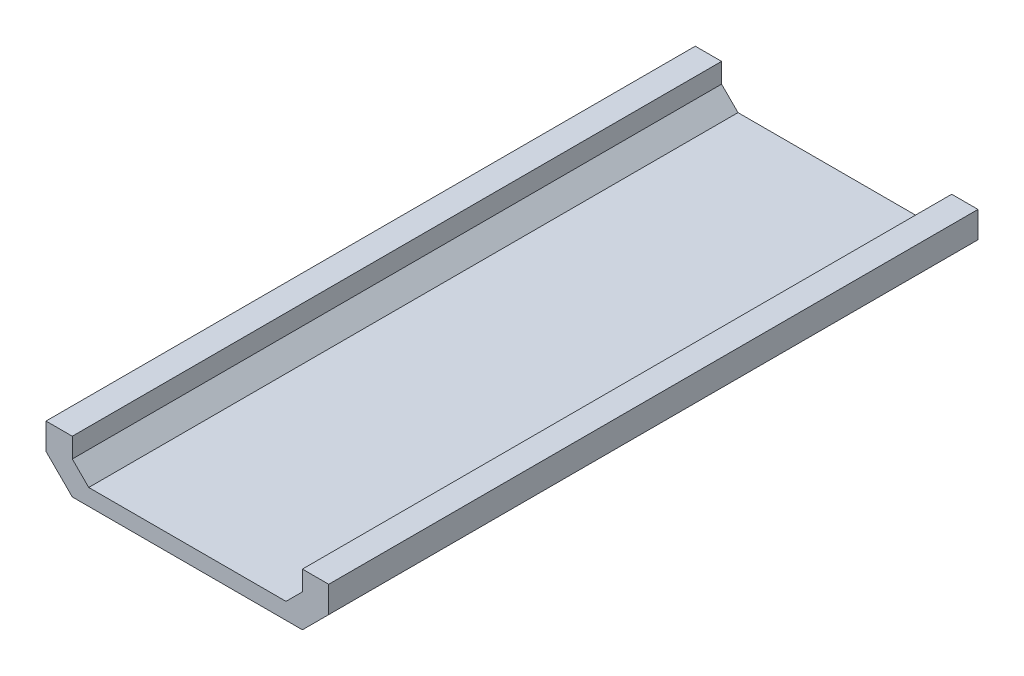
ISO-10303-21;
HEADER;
FILE_DESCRIPTION(('STEP AP214'),'2;1');
FILE_NAME('part.step','',(''),(''),'','','');
FILE_SCHEMA(('AUTOMOTIVE_DESIGN { 1 0 10303 214 1 1 1 1 }'));
ENDSEC;
DATA;
#1=APPLICATION_CONTEXT('core data for automotive mechanical design processes');
#2=APPLICATION_PROTOCOL_DEFINITION('international standard','automotive_design',2000,#1);
#3=PRODUCT_CONTEXT('',#1,'mechanical');
#4=PRODUCT('Part','Part','',(#3));
#5=PRODUCT_RELATED_PRODUCT_CATEGORY('part','',(#4));
#6=PRODUCT_DEFINITION_FORMATION('','',#4);
#7=PRODUCT_DEFINITION_CONTEXT('part definition',#1,'design');
#8=PRODUCT_DEFINITION('design','',#6,#7);
#9=PRODUCT_DEFINITION_SHAPE('','',#8);
#10=(LENGTH_UNIT() NAMED_UNIT(*) SI_UNIT(.MILLI.,.METRE.));
#11=(NAMED_UNIT(*) PLANE_ANGLE_UNIT() SI_UNIT($,.RADIAN.));
#12=(NAMED_UNIT(*) SI_UNIT($,.STERADIAN.) SOLID_ANGLE_UNIT());
#13=UNCERTAINTY_MEASURE_WITH_UNIT(LENGTH_MEASURE(1.E-05),#10,'distance_accuracy_value','');
#14=(GEOMETRIC_REPRESENTATION_CONTEXT(3) GLOBAL_UNCERTAINTY_ASSIGNED_CONTEXT((#13)) GLOBAL_UNIT_ASSIGNED_CONTEXT((#10,
#11,#12)) REPRESENTATION_CONTEXT('',''));
#15=CARTESIAN_POINT('',(0.,0.,0.));
#16=DIRECTION('',(0.,0.,1.));
#17=DIRECTION('',(1.,0.,0.));
#18=AXIS2_PLACEMENT_3D('',#15,#16,#17);
#19=CARTESIAN_POINT('',(34.9840802471779,-3.41215990108589,-111.692401632509));
#20=DIRECTION('',(0.707106781186544,-0.707106781186552,0.));
#21=DIRECTION('',(0.707106781186552,0.707106781186544,0.));
#22=AXIS2_PLACEMENT_3D('',#19,#20,#21);
#23=PLANE('',#22);
#24=DIRECTION('',(0.,0.,1.));
#25=VECTOR('',#24,1.);
#26=CARTESIAN_POINT('',(34.9840802471779,-3.41215990108589,-111.692401632509));
#27=LINE('',#26,#25);
#28=CARTESIAN_POINT('',(34.9840802471779,-3.41215990108589,-111.692401632509));
#29=VERTEX_POINT('',#28);
#30=CARTESIAN_POINT('',(34.9840802471779,-3.41215990108589,139.132598367491));
#31=VERTEX_POINT('',#30);
#32=EDGE_CURVE('E146',#29,#31,#27,.T.);
#33=ORIENTED_EDGE('',*,*,#32,.T.);
#34=DIRECTION('',(0.707106781186551,0.707106781186544,0.));
#35=VECTOR('',#34,1.);
#36=CARTESIAN_POINT('',(34.9840802471779,-3.41215990108589,139.132598367491));
#37=LINE('',#36,#35);
#38=CARTESIAN_POINT('',(41.3340802471779,2.93784009891411,139.132598367491));
#39=VERTEX_POINT('',#38);
#40=EDGE_CURVE('E139',#31,#39,#37,.T.);
#41=ORIENTED_EDGE('',*,*,#40,.T.);
#42=DIRECTION('',(0.,0.,1.));
#43=VECTOR('',#42,1.);
#44=CARTESIAN_POINT('',(41.3340802471779,2.93784009891411,-111.692401632509));
#45=LINE('',#44,#43);
#46=CARTESIAN_POINT('',(41.3340802471779,2.93784009891411,-111.692401632509));
#47=VERTEX_POINT('',#46);
#48=EDGE_CURVE('E11',#47,#39,#45,.T.);
#49=ORIENTED_EDGE('',*,*,#48,.F.);
#50=DIRECTION('',(0.707106781186551,0.707106781186544,0.));
#51=VECTOR('',#50,1.);
#52=CARTESIAN_POINT('',(34.9840802471779,-3.41215990108589,-111.692401632509));
#53=LINE('',#52,#51);
#54=EDGE_CURVE('E187',#29,#47,#53,.T.);
#55=ORIENTED_EDGE('',*,*,#54,.F.);
#56=EDGE_LOOP('',(#33,#41,#49,#55));
#57=FACE_BOUND('',#56,.T.);
#58=ADVANCED_FACE('F38',(#57),#23,.F.);
#59=CARTESIAN_POINT('',(41.3340802471779,2.93784009891411,-111.692401632509));
#60=DIRECTION('',(1.,0.,0.));
#61=DIRECTION('',(0.,0.,-1.));
#62=AXIS2_PLACEMENT_3D('',#59,#60,#61);
#63=PLANE('',#62);
#64=ORIENTED_EDGE('',*,*,#48,.T.);
#65=DIRECTION('',(0.,1.,0.));
#66=VECTOR('',#65,1.);
#67=CARTESIAN_POINT('',(41.3340802471779,2.93784009891411,139.132598367491));
#68=LINE('',#67,#66);
#69=CARTESIAN_POINT('',(41.3340802471779,10.5578400989141,139.132598367491));
#70=VERTEX_POINT('',#69);
#71=EDGE_CURVE('E129',#39,#70,#68,.T.);
#72=ORIENTED_EDGE('',*,*,#71,.T.);
#73=DIRECTION('',(0.,0.,1.));
#74=VECTOR('',#73,1.);
#75=CARTESIAN_POINT('',(41.3340802471779,10.5578400989141,-111.692401632509));
#76=LINE('',#75,#74);
#77=CARTESIAN_POINT('',(41.3340802471779,10.5578400989141,-111.692401632509));
#78=VERTEX_POINT('',#77);
#79=EDGE_CURVE('E46',#78,#70,#76,.T.);
#80=ORIENTED_EDGE('',*,*,#79,.F.);
#81=DIRECTION('',(0.,1.,0.));
#82=VECTOR('',#81,1.);
#83=CARTESIAN_POINT('',(41.3340802471779,2.93784009891411,-111.692401632509));
#84=LINE('',#83,#82);
#85=EDGE_CURVE('E130',#47,#78,#84,.T.);
#86=ORIENTED_EDGE('',*,*,#85,.F.);
#87=EDGE_LOOP('',(#64,#72,#80,#86));
#88=FACE_BOUND('',#87,.T.);
#89=ADVANCED_FACE('F127',(#88),#63,.F.);
#90=CARTESIAN_POINT('',(41.3340802471779,10.5578400989141,-111.692401632509));
#91=DIRECTION('',(0.,-1.,0.));
#92=DIRECTION('',(1.,0.,0.));
#93=AXIS2_PLACEMENT_3D('',#90,#91,#92);
#94=PLANE('',#93);
#95=ORIENTED_EDGE('',*,*,#79,.T.);
#96=DIRECTION('',(1.,0.,0.));
#97=VECTOR('',#96,1.);
#98=CARTESIAN_POINT('',(41.3340802471779,10.5578400989141,139.132598367491));
#99=LINE('',#98,#97);
#100=CARTESIAN_POINT('',(51.4940802471779,10.5578400989141,139.132598367491));
#101=VERTEX_POINT('',#100);
#102=EDGE_CURVE('E143',#70,#101,#99,.T.);
#103=ORIENTED_EDGE('',*,*,#102,.T.);
#104=DIRECTION('',(0.,0.,1.));
#105=VECTOR('',#104,1.);
#106=CARTESIAN_POINT('',(51.4940802471779,10.5578400989141,-111.692401632509));
#107=LINE('',#106,#105);
#108=CARTESIAN_POINT('',(51.4940802471779,10.5578400989141,-111.692401632509));
#109=VERTEX_POINT('',#108);
#110=EDGE_CURVE('E246',#109,#101,#107,.T.);
#111=ORIENTED_EDGE('',*,*,#110,.F.);
#112=DIRECTION('',(1.,0.,0.));
#113=VECTOR('',#112,1.);
#114=CARTESIAN_POINT('',(41.3340802471779,10.5578400989141,-111.692401632509));
#115=LINE('',#114,#113);
#116=EDGE_CURVE('E192',#78,#109,#115,.T.);
#117=ORIENTED_EDGE('',*,*,#116,.F.);
#118=EDGE_LOOP('',(#95,#103,#111,#117));
#119=FACE_BOUND('',#118,.T.);
#120=ADVANCED_FACE('F251',(#119),#94,.F.);
#121=CARTESIAN_POINT('',(51.4940802471779,10.5578400989141,-111.692401632509));
#122=DIRECTION('',(-1.,0.,0.));
#123=DIRECTION('',(0.,0.,1.));
#124=AXIS2_PLACEMENT_3D('',#121,#122,#123);
#125=PLANE('',#124);
#126=ORIENTED_EDGE('',*,*,#110,.T.);
#127=DIRECTION('',(0.,-1.,0.));
#128=VECTOR('',#127,1.);
#129=CARTESIAN_POINT('',(51.4940802471779,10.5578400989141,139.132598367491));
#130=LINE('',#129,#128);
#131=CARTESIAN_POINT('',(51.4940802471779,0.39784009891399,139.132598367491));
#132=VERTEX_POINT('',#131);
#133=EDGE_CURVE('E152',#101,#132,#130,.T.);
#134=ORIENTED_EDGE('',*,*,#133,.T.);
#135=DIRECTION('',(0.,0.,1.));
#136=VECTOR('',#135,1.);
#137=CARTESIAN_POINT('',(51.4940802471779,0.39784009891399,-111.692401632509));
#138=LINE('',#137,#136);
#139=CARTESIAN_POINT('',(51.4940802471779,0.39784009891399,-111.692401632509));
#140=VERTEX_POINT('',#139);
#141=EDGE_CURVE('E243',#140,#132,#138,.T.);
#142=ORIENTED_EDGE('',*,*,#141,.F.);
#143=DIRECTION('',(0.,-1.,0.));
#144=VECTOR('',#143,1.);
#145=CARTESIAN_POINT('',(51.4940802471779,10.5578400989141,-111.692401632509));
#146=LINE('',#145,#144);
#147=EDGE_CURVE('E195',#109,#140,#146,.T.);
#148=ORIENTED_EDGE('',*,*,#147,.F.);
#149=EDGE_LOOP('',(#126,#134,#142,#148));
#150=FACE_BOUND('',#149,.T.);
#151=ADVANCED_FACE('F259',(#150),#125,.F.);
#152=CARTESIAN_POINT('',(51.4940802471779,0.39784009891399,-111.692401632509));
#153=DIRECTION('',(-0.707106781186543,0.707106781186552,0.));
#154=DIRECTION('',(-0.707106781186552,-0.707106781186543,0.));
#155=AXIS2_PLACEMENT_3D('',#152,#153,#154);
#156=PLANE('',#155);
#157=ORIENTED_EDGE('',*,*,#141,.T.);
#158=DIRECTION('',(-0.707106781186552,-0.707106781186544,0.));
#159=VECTOR('',#158,1.);
#160=CARTESIAN_POINT('',(51.4940802471779,0.39784009891399,139.132598367491));
#161=LINE('',#160,#159);
#162=CARTESIAN_POINT('',(41.3340802471779,-9.76215990108589,139.132598367491));
#163=VERTEX_POINT('',#162);
#164=EDGE_CURVE('E156',#132,#163,#161,.T.);
#165=ORIENTED_EDGE('',*,*,#164,.T.);
#166=DIRECTION('',(0.,0.,1.));
#167=VECTOR('',#166,1.);
#168=CARTESIAN_POINT('',(41.3340802471779,-9.76215990108589,-111.692401632509));
#169=LINE('',#168,#167);
#170=CARTESIAN_POINT('',(41.3340802471779,-9.76215990108589,-111.692401632509));
#171=VERTEX_POINT('',#170);
#172=EDGE_CURVE('E240',#171,#163,#169,.T.);
#173=ORIENTED_EDGE('',*,*,#172,.F.);
#174=DIRECTION('',(-0.707106781186552,-0.707106781186544,0.));
#175=VECTOR('',#174,1.);
#176=CARTESIAN_POINT('',(51.4940802471779,0.39784009891399,-111.692401632509));
#177=LINE('',#176,#175);
#178=EDGE_CURVE('E198',#140,#171,#177,.T.);
#179=ORIENTED_EDGE('',*,*,#178,.F.);
#180=EDGE_LOOP('',(#157,#165,#173,#179));
#181=FACE_BOUND('',#180,.T.);
#182=ADVANCED_FACE('F262',(#181),#156,.F.);
#183=CARTESIAN_POINT('',(41.3340802471779,-9.76215990108589,-111.692401632509));
#184=DIRECTION('',(0.,1.,0.));
#185=DIRECTION('',(0.,0.,1.));
#186=AXIS2_PLACEMENT_3D('',#183,#184,#185);
#187=PLANE('',#186);
#188=ORIENTED_EDGE('',*,*,#172,.T.);
#189=DIRECTION('',(-1.,0.,0.));
#190=VECTOR('',#189,1.);
#191=CARTESIAN_POINT('',(41.3340802471779,-9.76215990108589,139.132598367491));
#192=LINE('',#191,#190);
#193=CARTESIAN_POINT('',(-47.5659197528222,-9.76215990108589,139.132598367491));
#194=VERTEX_POINT('',#193);
#195=EDGE_CURVE('E160',#163,#194,#192,.T.);
#196=ORIENTED_EDGE('',*,*,#195,.T.);
#197=DIRECTION('',(0.,0.,1.));
#198=VECTOR('',#197,1.);
#199=CARTESIAN_POINT('',(-47.5659197528222,-9.76215990108589,-111.692401632509));
#200=LINE('',#199,#198);
#201=CARTESIAN_POINT('',(-47.5659197528222,-9.76215990108589,-111.692401632509));
#202=VERTEX_POINT('',#201);
#203=EDGE_CURVE('E237',#202,#194,#200,.T.);
#204=ORIENTED_EDGE('',*,*,#203,.F.);
#205=DIRECTION('',(-1.,0.,0.));
#206=VECTOR('',#205,1.);
#207=CARTESIAN_POINT('',(41.3340802471779,-9.76215990108589,-111.692401632509));
#208=LINE('',#207,#206);
#209=EDGE_CURVE('E201',#171,#202,#208,.T.);
#210=ORIENTED_EDGE('',*,*,#209,.F.);
#211=EDGE_LOOP('',(#188,#196,#204,#210));
#212=FACE_BOUND('',#211,.T.);
#213=ADVANCED_FACE('F267',(#212),#187,.F.);
#214=CARTESIAN_POINT('',(-57.7259197528222,0.39784009891399,-111.692401632509));
#215=DIRECTION('',(0.707106781186543,0.707106781186552,0.));
#216=DIRECTION('',(-0.707106781186552,0.707106781186543,0.));
#217=AXIS2_PLACEMENT_3D('',#214,#215,#216);
#218=PLANE('',#217);
#219=ORIENTED_EDGE('',*,*,#203,.T.);
#220=DIRECTION('',(-0.707106781186552,0.707106781186543,0.));
#221=VECTOR('',#220,1.);
#222=CARTESIAN_POINT('',(-57.7259197528222,0.39784009891399,139.132598367491));
#223=LINE('',#222,#221);
#224=CARTESIAN_POINT('',(-57.7259197528222,0.39784009891399,139.132598367491));
#225=VERTEX_POINT('',#224);
#226=EDGE_CURVE('E164',#194,#225,#223,.T.);
#227=ORIENTED_EDGE('',*,*,#226,.T.);
#228=DIRECTION('',(0.,0.,1.));
#229=VECTOR('',#228,1.);
#230=CARTESIAN_POINT('',(-57.7259197528222,0.39784009891399,-111.692401632509));
#231=LINE('',#230,#229);
#232=CARTESIAN_POINT('',(-57.7259197528222,0.39784009891399,-111.692401632509));
#233=VERTEX_POINT('',#232);
#234=EDGE_CURVE('E234',#233,#225,#231,.T.);
#235=ORIENTED_EDGE('',*,*,#234,.F.);
#236=DIRECTION('',(-0.707106781186552,0.707106781186543,0.));
#237=VECTOR('',#236,1.);
#238=CARTESIAN_POINT('',(-57.7259197528222,0.39784009891399,-111.692401632509));
#239=LINE('',#238,#237);
#240=EDGE_CURVE('E204',#202,#233,#239,.T.);
#241=ORIENTED_EDGE('',*,*,#240,.F.);
#242=EDGE_LOOP('',(#219,#227,#235,#241));
#243=FACE_BOUND('',#242,.T.);
#244=ADVANCED_FACE('F273',(#243),#218,.F.);
#245=CARTESIAN_POINT('',(-57.7259197528222,10.5578400989141,-111.692401632509));
#246=DIRECTION('',(1.,0.,0.));
#247=DIRECTION('',(0.,0.,-1.));
#248=AXIS2_PLACEMENT_3D('',#245,#246,#247);
#249=PLANE('',#248);
#250=ORIENTED_EDGE('',*,*,#234,.T.);
#251=DIRECTION('',(0.,1.,0.));
#252=VECTOR('',#251,1.);
#253=CARTESIAN_POINT('',(-57.7259197528222,10.5578400989141,139.132598367491));
#254=LINE('',#253,#252);
#255=CARTESIAN_POINT('',(-57.7259197528222,10.5578400989141,139.132598367491));
#256=VERTEX_POINT('',#255);
#257=EDGE_CURVE('E168',#225,#256,#254,.T.);
#258=ORIENTED_EDGE('',*,*,#257,.T.);
#259=DIRECTION('',(0.,0.,1.));
#260=VECTOR('',#259,1.);
#261=CARTESIAN_POINT('',(-57.7259197528222,10.5578400989141,-111.692401632509));
#262=LINE('',#261,#260);
#263=CARTESIAN_POINT('',(-57.7259197528222,10.5578400989141,-111.692401632509));
#264=VERTEX_POINT('',#263);
#265=EDGE_CURVE('E231',#264,#256,#262,.T.);
#266=ORIENTED_EDGE('',*,*,#265,.F.);
#267=DIRECTION('',(0.,1.,0.));
#268=VECTOR('',#267,1.);
#269=CARTESIAN_POINT('',(-57.7259197528222,10.5578400989141,-111.692401632509));
#270=LINE('',#269,#268);
#271=EDGE_CURVE('E207',#233,#264,#270,.T.);
#272=ORIENTED_EDGE('',*,*,#271,.F.);
#273=EDGE_LOOP('',(#250,#258,#266,#272));
#274=FACE_BOUND('',#273,.T.);
#275=ADVANCED_FACE('F277',(#274),#249,.F.);
#276=CARTESIAN_POINT('',(-47.5659197528222,10.5578400989141,-111.692401632509));
#277=DIRECTION('',(0.,-1.,0.));
#278=DIRECTION('',(1.,0.,0.));
#279=AXIS2_PLACEMENT_3D('',#276,#277,#278);
#280=PLANE('',#279);
#281=ORIENTED_EDGE('',*,*,#265,.T.);
#282=DIRECTION('',(1.,0.,0.));
#283=VECTOR('',#282,1.);
#284=CARTESIAN_POINT('',(-47.5659197528222,10.5578400989141,139.132598367491));
#285=LINE('',#284,#283);
#286=CARTESIAN_POINT('',(-47.5659197528222,10.5578400989141,139.132598367491));
#287=VERTEX_POINT('',#286);
#288=EDGE_CURVE('E172',#256,#287,#285,.T.);
#289=ORIENTED_EDGE('',*,*,#288,.T.);
#290=DIRECTION('',(0.,0.,1.));
#291=VECTOR('',#290,1.);
#292=CARTESIAN_POINT('',(-47.5659197528222,10.5578400989141,-111.692401632509));
#293=LINE('',#292,#291);
#294=CARTESIAN_POINT('',(-47.5659197528222,10.5578400989141,-111.692401632509));
#295=VERTEX_POINT('',#294);
#296=EDGE_CURVE('E228',#295,#287,#293,.T.);
#297=ORIENTED_EDGE('',*,*,#296,.F.);
#298=DIRECTION('',(1.,0.,0.));
#299=VECTOR('',#298,1.);
#300=CARTESIAN_POINT('',(-47.5659197528222,10.5578400989141,-111.692401632509));
#301=LINE('',#300,#299);
#302=EDGE_CURVE('E210',#264,#295,#301,.T.);
#303=ORIENTED_EDGE('',*,*,#302,.F.);
#304=EDGE_LOOP('',(#281,#289,#297,#303));
#305=FACE_BOUND('',#304,.T.);
#306=ADVANCED_FACE('F282',(#305),#280,.F.);
#307=CARTESIAN_POINT('',(-47.5659197528222,2.93784009891411,-111.692401632509));
#308=DIRECTION('',(-1.,0.,0.));
#309=DIRECTION('',(0.,0.,1.));
#310=AXIS2_PLACEMENT_3D('',#307,#308,#309);
#311=PLANE('',#310);
#312=ORIENTED_EDGE('',*,*,#296,.T.);
#313=DIRECTION('',(0.,-1.,0.));
#314=VECTOR('',#313,1.);
#315=CARTESIAN_POINT('',(-47.5659197528222,2.93784009891411,139.132598367491));
#316=LINE('',#315,#314);
#317=CARTESIAN_POINT('',(-47.5659197528222,2.93784009891411,139.132598367491));
#318=VERTEX_POINT('',#317);
#319=EDGE_CURVE('E176',#287,#318,#316,.T.);
#320=ORIENTED_EDGE('',*,*,#319,.T.);
#321=DIRECTION('',(0.,0.,1.));
#322=VECTOR('',#321,1.);
#323=CARTESIAN_POINT('',(-47.5659197528222,2.93784009891411,-111.692401632509));
#324=LINE('',#323,#322);
#325=CARTESIAN_POINT('',(-47.5659197528222,2.93784009891411,-111.692401632509));
#326=VERTEX_POINT('',#325);
#327=EDGE_CURVE('E225',#326,#318,#324,.T.);
#328=ORIENTED_EDGE('',*,*,#327,.F.);
#329=DIRECTION('',(0.,-1.,0.));
#330=VECTOR('',#329,1.);
#331=CARTESIAN_POINT('',(-47.5659197528222,2.93784009891411,-111.692401632509));
#332=LINE('',#331,#330);
#333=EDGE_CURVE('E213',#295,#326,#332,.T.);
#334=ORIENTED_EDGE('',*,*,#333,.F.);
#335=EDGE_LOOP('',(#312,#320,#328,#334));
#336=FACE_BOUND('',#335,.T.);
#337=ADVANCED_FACE('F286',(#336),#311,.F.);
#338=CARTESIAN_POINT('',(-41.2159197528221,-3.41215990108588,-111.692401632509));
#339=DIRECTION('',(-0.707106781186543,-0.707106781186552,0.));
#340=DIRECTION('',(0.707106781186552,-0.707106781186543,0.));
#341=AXIS2_PLACEMENT_3D('',#338,#339,#340);
#342=PLANE('',#341);
#343=ORIENTED_EDGE('',*,*,#327,.T.);
#344=DIRECTION('',(0.707106781186552,-0.707106781186544,0.));
#345=VECTOR('',#344,1.);
#346=CARTESIAN_POINT('',(-41.2159197528221,-3.41215990108588,139.132598367491));
#347=LINE('',#346,#345);
#348=CARTESIAN_POINT('',(-41.2159197528221,-3.41215990108588,139.132598367491));
#349=VERTEX_POINT('',#348);
#350=EDGE_CURVE('E180',#318,#349,#347,.T.);
#351=ORIENTED_EDGE('',*,*,#350,.T.);
#352=DIRECTION('',(0.,0.,1.));
#353=VECTOR('',#352,1.);
#354=CARTESIAN_POINT('',(-41.2159197528221,-3.41215990108588,-111.692401632509));
#355=LINE('',#354,#353);
#356=CARTESIAN_POINT('',(-41.2159197528221,-3.41215990108588,-111.692401632509));
#357=VERTEX_POINT('',#356);
#358=EDGE_CURVE('E222',#357,#349,#355,.T.);
#359=ORIENTED_EDGE('',*,*,#358,.F.);
#360=DIRECTION('',(0.707106781186552,-0.707106781186544,0.));
#361=VECTOR('',#360,1.);
#362=CARTESIAN_POINT('',(-41.2159197528221,-3.41215990108588,-111.692401632509));
#363=LINE('',#362,#361);
#364=EDGE_CURVE('E58',#326,#357,#363,.T.);
#365=ORIENTED_EDGE('',*,*,#364,.F.);
#366=EDGE_LOOP('',(#343,#351,#359,#365));
#367=FACE_BOUND('',#366,.T.);
#368=ADVANCED_FACE('F290',(#367),#342,.F.);
#369=CARTESIAN_POINT('',(34.9840802471779,-3.41215990108589,-111.692401632509));
#370=DIRECTION('',(0.,-1.,0.));
#371=DIRECTION('',(1.,0.,0.));
#372=AXIS2_PLACEMENT_3D('',#369,#370,#371);
#373=PLANE('',#372);
#374=ORIENTED_EDGE('',*,*,#358,.T.);
#375=DIRECTION('',(1.,0.,0.));
#376=VECTOR('',#375,1.);
#377=CARTESIAN_POINT('',(34.9840802471779,-3.41215990108589,139.132598367491));
#378=LINE('',#377,#376);
#379=EDGE_CURVE('E184',#349,#31,#378,.T.);
#380=ORIENTED_EDGE('',*,*,#379,.T.);
#381=ORIENTED_EDGE('',*,*,#32,.F.);
#382=DIRECTION('',(1.,0.,0.));
#383=VECTOR('',#382,1.);
#384=CARTESIAN_POINT('',(34.9840802471779,-3.41215990108589,-111.692401632509));
#385=LINE('',#384,#383);
#386=EDGE_CURVE('E53',#357,#29,#385,.T.);
#387=ORIENTED_EDGE('',*,*,#386,.F.);
#388=EDGE_LOOP('',(#374,#380,#381,#387));
#389=FACE_BOUND('',#388,.T.);
#390=ADVANCED_FACE('F292',(#389),#373,.F.);
#391=CARTESIAN_POINT('',(15.0337368144526,8.22268346316402,-111.692401632509));
#392=DIRECTION('',(0.,0.,-1.));
#393=DIRECTION('',(-1.,0.,0.));
#394=AXIS2_PLACEMENT_3D('',#391,#392,#393);
#395=PLANE('',#394);
#396=ORIENTED_EDGE('',*,*,#54,.T.);
#397=ORIENTED_EDGE('',*,*,#85,.T.);
#398=ORIENTED_EDGE('',*,*,#116,.T.);
#399=ORIENTED_EDGE('',*,*,#147,.T.);
#400=ORIENTED_EDGE('',*,*,#178,.T.);
#401=ORIENTED_EDGE('',*,*,#209,.T.);
#402=ORIENTED_EDGE('',*,*,#240,.T.);
#403=ORIENTED_EDGE('',*,*,#271,.T.);
#404=ORIENTED_EDGE('',*,*,#302,.T.);
#405=ORIENTED_EDGE('',*,*,#333,.T.);
#406=ORIENTED_EDGE('',*,*,#364,.T.);
#407=ORIENTED_EDGE('',*,*,#386,.T.);
#408=EDGE_LOOP('',(#396,#397,#398,#399,#400,#401,#402,#403,#404,#405,#406,#407));
#409=FACE_BOUND('',#408,.T.);
#410=ADVANCED_FACE('F254',(#409),#395,.T.);
#411=CARTESIAN_POINT('',(15.0337368144526,8.22268346316402,139.132598367491));
#412=DIRECTION('',(0.,0.,-1.));
#413=DIRECTION('',(-1.,0.,0.));
#414=AXIS2_PLACEMENT_3D('',#411,#412,#413);
#415=PLANE('',#414);
#416=ORIENTED_EDGE('',*,*,#40,.F.);
#417=ORIENTED_EDGE('',*,*,#379,.F.);
#418=ORIENTED_EDGE('',*,*,#350,.F.);
#419=ORIENTED_EDGE('',*,*,#319,.F.);
#420=ORIENTED_EDGE('',*,*,#288,.F.);
#421=ORIENTED_EDGE('',*,*,#257,.F.);
#422=ORIENTED_EDGE('',*,*,#226,.F.);
#423=ORIENTED_EDGE('',*,*,#195,.F.);
#424=ORIENTED_EDGE('',*,*,#164,.F.);
#425=ORIENTED_EDGE('',*,*,#133,.F.);
#426=ORIENTED_EDGE('',*,*,#102,.F.);
#427=ORIENTED_EDGE('',*,*,#71,.F.);
#428=EDGE_LOOP('',(#416,#417,#418,#419,#420,#421,#422,#423,#424,#425,#426,#427));
#429=FACE_BOUND('',#428,.T.);
#430=ADVANCED_FACE('F137',(#429),#415,.F.);
#431=CLOSED_SHELL('',(#58,#89,#120,#151,#182,#213,#244,#275,#306,#337,#368,#390,#410,#430));
#432=MANIFOLD_SOLID_BREP('B2',#431);
#433=ADVANCED_BREP_SHAPE_REPRESENTATION('',(#18,#432),#14);
#434=SHAPE_DEFINITION_REPRESENTATION(#9,#433);
ENDSEC;
END-ISO-10303-21;
